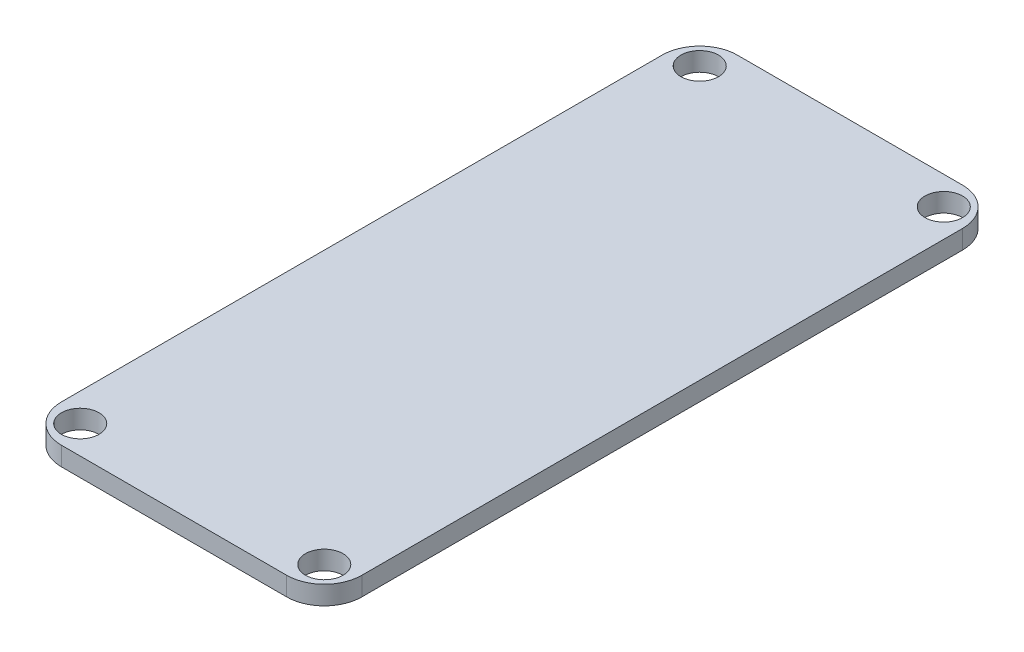
ISO-10303-21;
HEADER;
FILE_DESCRIPTION(('STEP AP214'),'2;1');
FILE_NAME('part.step','',(''),(''),'','','');
FILE_SCHEMA(('AUTOMOTIVE_DESIGN { 1 0 10303 214 1 1 1 1 }'));
ENDSEC;
DATA;
#1=APPLICATION_CONTEXT('core data for automotive mechanical design processes');
#2=APPLICATION_PROTOCOL_DEFINITION('international standard','automotive_design',2000,#1);
#3=PRODUCT_CONTEXT('',#1,'mechanical');
#4=PRODUCT('Part','Part','',(#3));
#5=PRODUCT_RELATED_PRODUCT_CATEGORY('part','',(#4));
#6=PRODUCT_DEFINITION_FORMATION('','',#4);
#7=PRODUCT_DEFINITION_CONTEXT('part definition',#1,'design');
#8=PRODUCT_DEFINITION('design','',#6,#7);
#9=PRODUCT_DEFINITION_SHAPE('','',#8);
#10=(LENGTH_UNIT() NAMED_UNIT(*) SI_UNIT(.MILLI.,.METRE.));
#11=(NAMED_UNIT(*) PLANE_ANGLE_UNIT() SI_UNIT($,.RADIAN.));
#12=(NAMED_UNIT(*) SI_UNIT($,.STERADIAN.) SOLID_ANGLE_UNIT());
#13=UNCERTAINTY_MEASURE_WITH_UNIT(LENGTH_MEASURE(1.E-05),#10,'distance_accuracy_value','');
#14=(GEOMETRIC_REPRESENTATION_CONTEXT(3) GLOBAL_UNCERTAINTY_ASSIGNED_CONTEXT((#13)) GLOBAL_UNIT_ASSIGNED_CONTEXT((#10,
#11,#12)) REPRESENTATION_CONTEXT('',''));
#15=CARTESIAN_POINT('',(0.,0.,0.));
#16=DIRECTION('',(0.,0.,1.));
#17=DIRECTION('',(1.,0.,0.));
#18=AXIS2_PLACEMENT_3D('',#15,#16,#17);
#19=CARTESIAN_POINT('',(0.,1.5875,0.));
#20=DIRECTION('',(1.,0.,0.));
#21=DIRECTION('',(0.,0.,-1.));
#22=AXIS2_PLACEMENT_3D('',#19,#20,#21);
#23=PLANE('',#22);
#24=DIRECTION('',(0.,0.,1.));
#25=VECTOR('',#24,1.);
#26=CARTESIAN_POINT('',(0.,1.5875,0.));
#27=LINE('',#26,#25);
#28=CARTESIAN_POINT('',(0.,1.5875,-53.975));
#29=VERTEX_POINT('',#28);
#30=CARTESIAN_POINT('',(0.,1.5875,-3.175));
#31=VERTEX_POINT('',#30);
#32=EDGE_CURVE('E130',#29,#31,#27,.T.);
#33=ORIENTED_EDGE('',*,*,#32,.F.);
#34=DIRECTION('',(0.,-1.,0.));
#35=VECTOR('',#34,1.);
#36=CARTESIAN_POINT('',(0.,1.5875,-53.975));
#37=LINE('',#36,#35);
#38=CARTESIAN_POINT('',(0.,0.,-53.975));
#39=VERTEX_POINT('',#38);
#40=EDGE_CURVE('E114',#29,#39,#37,.T.);
#41=ORIENTED_EDGE('',*,*,#40,.T.);
#42=DIRECTION('',(0.,0.,1.));
#43=VECTOR('',#42,1.);
#44=CARTESIAN_POINT('',(0.,0.,0.));
#45=LINE('',#44,#43);
#46=CARTESIAN_POINT('',(0.,0.,-3.175));
#47=VERTEX_POINT('',#46);
#48=EDGE_CURVE('E127',#39,#47,#45,.T.);
#49=ORIENTED_EDGE('',*,*,#48,.T.);
#50=DIRECTION('',(0.,-1.,0.));
#51=VECTOR('',#50,1.);
#52=CARTESIAN_POINT('',(0.,1.5875,-3.175));
#53=LINE('',#52,#51);
#54=EDGE_CURVE('E133',#47,#31,#53,.F.);
#55=ORIENTED_EDGE('',*,*,#54,.T.);
#56=EDGE_LOOP('',(#33,#41,#49,#55));
#57=FACE_BOUND('',#56,.T.);
#58=ADVANCED_FACE('F43',(#57),#23,.F.);
#59=CARTESIAN_POINT('',(0.,1.5875,0.));
#60=DIRECTION('',(0.,0.,-1.));
#61=DIRECTION('',(-1.,0.,0.));
#62=AXIS2_PLACEMENT_3D('',#59,#60,#61);
#63=PLANE('',#62);
#64=DIRECTION('',(1.,0.,0.));
#65=VECTOR('',#64,1.);
#66=CARTESIAN_POINT('',(0.,0.,0.));
#67=LINE('',#66,#65);
#68=CARTESIAN_POINT('',(3.175,0.,0.));
#69=VERTEX_POINT('',#68);
#70=CARTESIAN_POINT('',(22.225,0.,0.));
#71=VERTEX_POINT('',#70);
#72=EDGE_CURVE('E138',#69,#71,#67,.T.);
#73=ORIENTED_EDGE('',*,*,#72,.T.);
#74=DIRECTION('',(0.,-1.,0.));
#75=VECTOR('',#74,1.);
#76=CARTESIAN_POINT('',(22.225,1.5875,0.));
#77=LINE('',#76,#75);
#78=CARTESIAN_POINT('',(22.225,1.5875,0.));
#79=VERTEX_POINT('',#78);
#80=EDGE_CURVE('E11',#71,#79,#77,.F.);
#81=ORIENTED_EDGE('',*,*,#80,.T.);
#82=DIRECTION('',(1.,0.,0.));
#83=VECTOR('',#82,1.);
#84=CARTESIAN_POINT('',(0.,1.5875,0.));
#85=LINE('',#84,#83);
#86=CARTESIAN_POINT('',(3.175,1.5875,0.));
#87=VERTEX_POINT('',#86);
#88=EDGE_CURVE('E195',#87,#79,#85,.T.);
#89=ORIENTED_EDGE('',*,*,#88,.F.);
#90=DIRECTION('',(0.,-1.,0.));
#91=VECTOR('',#90,1.);
#92=CARTESIAN_POINT('',(3.175,1.5875,0.));
#93=LINE('',#92,#91);
#94=EDGE_CURVE('E52',#87,#69,#93,.T.);
#95=ORIENTED_EDGE('',*,*,#94,.T.);
#96=EDGE_LOOP('',(#73,#81,#89,#95));
#97=FACE_BOUND('',#96,.T.);
#98=ADVANCED_FACE('F193',(#97),#63,.F.);
#99=CARTESIAN_POINT('',(25.4,1.5875,0.));
#100=DIRECTION('',(-1.,0.,0.));
#101=DIRECTION('',(0.,0.,1.));
#102=AXIS2_PLACEMENT_3D('',#99,#100,#101);
#103=PLANE('',#102);
#104=DIRECTION('',(0.,0.,-1.));
#105=VECTOR('',#104,1.);
#106=CARTESIAN_POINT('',(25.4,0.,0.));
#107=LINE('',#106,#105);
#108=CARTESIAN_POINT('',(25.4,0.,-3.175));
#109=VERTEX_POINT('',#108);
#110=CARTESIAN_POINT('',(25.4,0.,-53.975));
#111=VERTEX_POINT('',#110);
#112=EDGE_CURVE('E144',#109,#111,#107,.T.);
#113=ORIENTED_EDGE('',*,*,#112,.T.);
#114=DIRECTION('',(0.,-1.,0.));
#115=VECTOR('',#114,1.);
#116=CARTESIAN_POINT('',(25.4,1.5875,-53.975));
#117=LINE('',#116,#115);
#118=CARTESIAN_POINT('',(25.4,1.5875,-53.975));
#119=VERTEX_POINT('',#118);
#120=EDGE_CURVE('E59',#111,#119,#117,.F.);
#121=ORIENTED_EDGE('',*,*,#120,.T.);
#122=DIRECTION('',(0.,0.,-1.));
#123=VECTOR('',#122,1.);
#124=CARTESIAN_POINT('',(25.4,1.5875,0.));
#125=LINE('',#124,#123);
#126=CARTESIAN_POINT('',(25.4,1.5875,-3.175));
#127=VERTEX_POINT('',#126);
#128=EDGE_CURVE('E203',#127,#119,#125,.T.);
#129=ORIENTED_EDGE('',*,*,#128,.F.);
#130=DIRECTION('',(0.,-1.,0.));
#131=VECTOR('',#130,1.);
#132=CARTESIAN_POINT('',(25.4,1.5875,-3.175));
#133=LINE('',#132,#131);
#134=EDGE_CURVE('E183',#127,#109,#133,.T.);
#135=ORIENTED_EDGE('',*,*,#134,.T.);
#136=EDGE_LOOP('',(#113,#121,#129,#135));
#137=FACE_BOUND('',#136,.T.);
#138=ADVANCED_FACE('F202',(#137),#103,.F.);
#139=CARTESIAN_POINT('',(0.,1.5875,-57.15));
#140=DIRECTION('',(0.,0.,1.));
#141=DIRECTION('',(1.,0.,0.));
#142=AXIS2_PLACEMENT_3D('',#139,#140,#141);
#143=PLANE('',#142);
#144=DIRECTION('',(-1.,0.,0.));
#145=VECTOR('',#144,1.);
#146=CARTESIAN_POINT('',(0.,0.,-57.15));
#147=LINE('',#146,#145);
#148=CARTESIAN_POINT('',(22.225,0.,-57.15));
#149=VERTEX_POINT('',#148);
#150=CARTESIAN_POINT('',(3.175,0.,-57.15));
#151=VERTEX_POINT('',#150);
#152=EDGE_CURVE('E155',#149,#151,#147,.T.);
#153=ORIENTED_EDGE('',*,*,#152,.T.);
#154=DIRECTION('',(0.,-1.,0.));
#155=VECTOR('',#154,1.);
#156=CARTESIAN_POINT('',(3.175,1.5875,-57.15));
#157=LINE('',#156,#155);
#158=CARTESIAN_POINT('',(3.175,1.5875,-57.15));
#159=VERTEX_POINT('',#158);
#160=EDGE_CURVE('E115',#151,#159,#157,.F.);
#161=ORIENTED_EDGE('',*,*,#160,.T.);
#162=DIRECTION('',(-1.,0.,0.));
#163=VECTOR('',#162,1.);
#164=CARTESIAN_POINT('',(0.,1.5875,-57.15));
#165=LINE('',#164,#163);
#166=CARTESIAN_POINT('',(22.225,1.5875,-57.15));
#167=VERTEX_POINT('',#166);
#168=EDGE_CURVE('E150',#167,#159,#165,.T.);
#169=ORIENTED_EDGE('',*,*,#168,.F.);
#170=DIRECTION('',(0.,-1.,0.));
#171=VECTOR('',#170,1.);
#172=CARTESIAN_POINT('',(22.225,1.5875,-57.15));
#173=LINE('',#172,#171);
#174=EDGE_CURVE('E121',#167,#149,#173,.T.);
#175=ORIENTED_EDGE('',*,*,#174,.T.);
#176=EDGE_LOOP('',(#153,#161,#169,#175));
#177=FACE_BOUND('',#176,.T.);
#178=ADVANCED_FACE('F246',(#177),#143,.F.);
#179=CARTESIAN_POINT('',(0.,1.5875,0.));
#180=DIRECTION('',(0.,-1.,0.));
#181=DIRECTION('',(0.,0.,-1.));
#182=AXIS2_PLACEMENT_3D('',#179,#180,#181);
#183=PLANE('',#182);
#184=CARTESIAN_POINT('',(2.38125,1.5875,-54.76875));
#185=DIRECTION('',(0.,1.,0.));
#186=DIRECTION('',(0.,0.,1.));
#187=AXIS2_PLACEMENT_3D('',#184,#185,#186);
#188=CIRCLE('',#187,1.5875);
#189=CARTESIAN_POINT('',(2.38125,1.5875,-53.18125));
#190=VERTEX_POINT('',#189);
#191=EDGE_CURVE('E215',#190,#190,#188,.T.);
#192=ORIENTED_EDGE('',*,*,#191,.F.);
#193=EDGE_LOOP('',(#192));
#194=FACE_BOUND('',#193,.T.);
#195=CARTESIAN_POINT('',(23.01875,1.5875,-2.38125));
#196=DIRECTION('',(0.,1.,0.));
#197=DIRECTION('',(0.,0.,1.));
#198=AXIS2_PLACEMENT_3D('',#195,#196,#197);
#199=CIRCLE('',#198,1.5875);
#200=CARTESIAN_POINT('',(23.01875,1.5875,-0.793750000000001));
#201=VERTEX_POINT('',#200);
#202=EDGE_CURVE('E221',#201,#201,#199,.T.);
#203=ORIENTED_EDGE('',*,*,#202,.F.);
#204=EDGE_LOOP('',(#203));
#205=FACE_BOUND('',#204,.T.);
#206=CARTESIAN_POINT('',(2.38125,1.5875,-2.38125));
#207=DIRECTION('',(0.,1.,0.));
#208=DIRECTION('',(0.,0.,1.));
#209=AXIS2_PLACEMENT_3D('',#206,#207,#208);
#210=CIRCLE('',#209,1.5875);
#211=CARTESIAN_POINT('',(2.38125,1.5875,-0.79375));
#212=VERTEX_POINT('',#211);
#213=EDGE_CURVE('E222',#212,#212,#210,.T.);
#214=ORIENTED_EDGE('',*,*,#213,.F.);
#215=EDGE_LOOP('',(#214));
#216=FACE_BOUND('',#215,.T.);
#217=CARTESIAN_POINT('',(23.01875,1.5875,-54.76875));
#218=DIRECTION('',(0.,1.,0.));
#219=DIRECTION('',(0.,0.,1.));
#220=AXIS2_PLACEMENT_3D('',#217,#218,#219);
#221=CIRCLE('',#220,1.5875);
#222=CARTESIAN_POINT('',(23.01875,1.5875,-53.18125));
#223=VERTEX_POINT('',#222);
#224=EDGE_CURVE('E147',#223,#223,#221,.T.);
#225=ORIENTED_EDGE('',*,*,#224,.F.);
#226=EDGE_LOOP('',(#225));
#227=FACE_BOUND('',#226,.T.);
#228=ORIENTED_EDGE('',*,*,#168,.T.);
#229=CARTESIAN_POINT('',(3.175,1.5875,-53.975));
#230=DIRECTION('',(0.,-1.,0.));
#231=DIRECTION('',(0.,0.,-1.));
#232=AXIS2_PLACEMENT_3D('',#229,#230,#231);
#233=CIRCLE('',#232,3.175);
#234=EDGE_CURVE('E180',#159,#29,#233,.F.);
#235=ORIENTED_EDGE('',*,*,#234,.T.);
#236=ORIENTED_EDGE('',*,*,#32,.T.);
#237=CARTESIAN_POINT('',(3.175,1.5875,-3.175));
#238=DIRECTION('',(0.,-1.,0.));
#239=DIRECTION('',(0.,0.,-1.));
#240=AXIS2_PLACEMENT_3D('',#237,#238,#239);
#241=CIRCLE('',#240,3.175);
#242=EDGE_CURVE('E172',#31,#87,#241,.F.);
#243=ORIENTED_EDGE('',*,*,#242,.T.);
#244=ORIENTED_EDGE('',*,*,#88,.T.);
#245=CARTESIAN_POINT('',(22.225,1.5875,-3.175));
#246=DIRECTION('',(0.,-1.,0.));
#247=DIRECTION('',(0.,0.,-1.));
#248=AXIS2_PLACEMENT_3D('',#245,#246,#247);
#249=CIRCLE('',#248,3.175);
#250=EDGE_CURVE('E66',#79,#127,#249,.F.);
#251=ORIENTED_EDGE('',*,*,#250,.T.);
#252=ORIENTED_EDGE('',*,*,#128,.T.);
#253=CARTESIAN_POINT('',(22.225,1.5875,-53.975));
#254=DIRECTION('',(0.,-1.,0.));
#255=DIRECTION('',(0.,0.,-1.));
#256=AXIS2_PLACEMENT_3D('',#253,#254,#255);
#257=CIRCLE('',#256,3.175);
#258=EDGE_CURVE('E177',#119,#167,#257,.F.);
#259=ORIENTED_EDGE('',*,*,#258,.T.);
#260=EDGE_LOOP('',(#228,#235,#236,#243,#244,#251,#252,#259));
#261=FACE_BOUND('',#260,.T.);
#262=ADVANCED_FACE('F243',(#194,#205,#216,#227,#261),#183,.F.);
#263=CARTESIAN_POINT('',(0.,0.,0.));
#264=DIRECTION('',(0.,-1.,0.));
#265=DIRECTION('',(0.,0.,-1.));
#266=AXIS2_PLACEMENT_3D('',#263,#264,#265);
#267=PLANE('',#266);
#268=CARTESIAN_POINT('',(2.38125,0.,-54.76875));
#269=DIRECTION('',(0.,1.,0.));
#270=DIRECTION('',(0.,0.,1.));
#271=AXIS2_PLACEMENT_3D('',#268,#269,#270);
#272=CIRCLE('',#271,1.5875);
#273=CARTESIAN_POINT('',(2.38125,0.,-53.18125));
#274=VERTEX_POINT('',#273);
#275=EDGE_CURVE('E226',#274,#274,#272,.T.);
#276=ORIENTED_EDGE('',*,*,#275,.T.);
#277=EDGE_LOOP('',(#276));
#278=FACE_BOUND('',#277,.T.);
#279=CARTESIAN_POINT('',(23.01875,0.,-2.38125));
#280=DIRECTION('',(0.,1.,0.));
#281=DIRECTION('',(0.,0.,1.));
#282=AXIS2_PLACEMENT_3D('',#279,#280,#281);
#283=CIRCLE('',#282,1.5875);
#284=CARTESIAN_POINT('',(23.01875,0.,-0.793750000000001));
#285=VERTEX_POINT('',#284);
#286=EDGE_CURVE('E217',#285,#285,#283,.T.);
#287=ORIENTED_EDGE('',*,*,#286,.T.);
#288=EDGE_LOOP('',(#287));
#289=FACE_BOUND('',#288,.T.);
#290=CARTESIAN_POINT('',(2.38125,0.,-2.38125));
#291=DIRECTION('',(0.,1.,0.));
#292=DIRECTION('',(0.,0.,1.));
#293=AXIS2_PLACEMENT_3D('',#290,#291,#292);
#294=CIRCLE('',#293,1.5875);
#295=CARTESIAN_POINT('',(2.38125,0.,-0.79375));
#296=VERTEX_POINT('',#295);
#297=EDGE_CURVE('E233',#296,#296,#294,.T.);
#298=ORIENTED_EDGE('',*,*,#297,.T.);
#299=EDGE_LOOP('',(#298));
#300=FACE_BOUND('',#299,.T.);
#301=CARTESIAN_POINT('',(23.01875,0.,-54.76875));
#302=DIRECTION('',(0.,1.,0.));
#303=DIRECTION('',(0.,0.,1.));
#304=AXIS2_PLACEMENT_3D('',#301,#302,#303);
#305=CIRCLE('',#304,1.5875);
#306=CARTESIAN_POINT('',(23.01875,0.,-53.18125));
#307=VERTEX_POINT('',#306);
#308=EDGE_CURVE('E139',#307,#307,#305,.T.);
#309=ORIENTED_EDGE('',*,*,#308,.T.);
#310=EDGE_LOOP('',(#309));
#311=FACE_BOUND('',#310,.T.);
#312=ORIENTED_EDGE('',*,*,#48,.F.);
#313=CARTESIAN_POINT('',(3.175,0.,-53.975));
#314=DIRECTION('',(0.,-1.,0.));
#315=DIRECTION('',(0.,0.,-1.));
#316=AXIS2_PLACEMENT_3D('',#313,#314,#315);
#317=CIRCLE('',#316,3.175);
#318=EDGE_CURVE('E110',#39,#151,#317,.T.);
#319=ORIENTED_EDGE('',*,*,#318,.T.);
#320=ORIENTED_EDGE('',*,*,#152,.F.);
#321=CARTESIAN_POINT('',(22.225,0.,-53.975));
#322=DIRECTION('',(0.,-1.,0.));
#323=DIRECTION('',(0.,0.,-1.));
#324=AXIS2_PLACEMENT_3D('',#321,#322,#323);
#325=CIRCLE('',#324,3.175);
#326=EDGE_CURVE('E122',#149,#111,#325,.T.);
#327=ORIENTED_EDGE('',*,*,#326,.T.);
#328=ORIENTED_EDGE('',*,*,#112,.F.);
#329=CARTESIAN_POINT('',(22.225,0.,-3.175));
#330=DIRECTION('',(0.,-1.,0.));
#331=DIRECTION('',(0.,0.,-1.));
#332=AXIS2_PLACEMENT_3D('',#329,#330,#331);
#333=CIRCLE('',#332,3.175);
#334=EDGE_CURVE('E162',#109,#71,#333,.T.);
#335=ORIENTED_EDGE('',*,*,#334,.T.);
#336=ORIENTED_EDGE('',*,*,#72,.F.);
#337=CARTESIAN_POINT('',(3.175,0.,-3.175));
#338=DIRECTION('',(0.,-1.,0.));
#339=DIRECTION('',(0.,0.,-1.));
#340=AXIS2_PLACEMENT_3D('',#337,#338,#339);
#341=CIRCLE('',#340,3.175);
#342=EDGE_CURVE('E132',#69,#47,#341,.T.);
#343=ORIENTED_EDGE('',*,*,#342,.T.);
#344=EDGE_LOOP('',(#312,#319,#320,#327,#328,#335,#336,#343));
#345=FACE_BOUND('',#344,.T.);
#346=ADVANCED_FACE('F135',(#278,#289,#300,#311,#345),#267,.T.);
#347=CARTESIAN_POINT('',(23.01875,0.,-54.76875));
#348=DIRECTION('',(0.,1.,0.));
#349=DIRECTION('',(0.,0.,1.));
#350=AXIS2_PLACEMENT_3D('',#347,#348,#349);
#351=CYLINDRICAL_SURFACE('',#350,1.5875);
#352=ORIENTED_EDGE('',*,*,#308,.F.);
#353=EDGE_LOOP('',(#352));
#354=FACE_BOUND('',#353,.T.);
#355=ORIENTED_EDGE('',*,*,#224,.T.);
#356=EDGE_LOOP('',(#355));
#357=FACE_BOUND('',#356,.T.);
#358=ADVANCED_FACE('F275',(#354,#357),#351,.F.);
#359=CARTESIAN_POINT('',(2.38125,0.,-2.38125));
#360=DIRECTION('',(0.,1.,0.));
#361=DIRECTION('',(0.,0.,1.));
#362=AXIS2_PLACEMENT_3D('',#359,#360,#361);
#363=CYLINDRICAL_SURFACE('',#362,1.5875);
#364=ORIENTED_EDGE('',*,*,#297,.F.);
#365=EDGE_LOOP('',(#364));
#366=FACE_BOUND('',#365,.T.);
#367=ORIENTED_EDGE('',*,*,#213,.T.);
#368=EDGE_LOOP('',(#367));
#369=FACE_BOUND('',#368,.T.);
#370=ADVANCED_FACE('F241',(#366,#369),#363,.F.);
#371=CARTESIAN_POINT('',(23.01875,0.,-2.38125));
#372=DIRECTION('',(0.,1.,0.));
#373=DIRECTION('',(0.,0.,1.));
#374=AXIS2_PLACEMENT_3D('',#371,#372,#373);
#375=CYLINDRICAL_SURFACE('',#374,1.5875);
#376=ORIENTED_EDGE('',*,*,#286,.F.);
#377=EDGE_LOOP('',(#376));
#378=FACE_BOUND('',#377,.T.);
#379=ORIENTED_EDGE('',*,*,#202,.T.);
#380=EDGE_LOOP('',(#379));
#381=FACE_BOUND('',#380,.T.);
#382=ADVANCED_FACE('F281',(#378,#381),#375,.F.);
#383=CARTESIAN_POINT('',(2.38125,0.,-54.76875));
#384=DIRECTION('',(0.,1.,0.));
#385=DIRECTION('',(0.,0.,1.));
#386=AXIS2_PLACEMENT_3D('',#383,#384,#385);
#387=CYLINDRICAL_SURFACE('',#386,1.5875);
#388=ORIENTED_EDGE('',*,*,#275,.F.);
#389=EDGE_LOOP('',(#388));
#390=FACE_BOUND('',#389,.T.);
#391=ORIENTED_EDGE('',*,*,#191,.T.);
#392=EDGE_LOOP('',(#391));
#393=FACE_BOUND('',#392,.T.);
#394=ADVANCED_FACE('F261',(#390,#393),#387,.F.);
#395=CARTESIAN_POINT('',(3.175,1.5875,-53.975));
#396=DIRECTION('',(0.,-1.,0.));
#397=DIRECTION('',(0.,0.,-1.));
#398=AXIS2_PLACEMENT_3D('',#395,#396,#397);
#399=CYLINDRICAL_SURFACE('',#398,3.175);
#400=ORIENTED_EDGE('',*,*,#234,.F.);
#401=ORIENTED_EDGE('',*,*,#160,.F.);
#402=ORIENTED_EDGE('',*,*,#318,.F.);
#403=ORIENTED_EDGE('',*,*,#40,.F.);
#404=EDGE_LOOP('',(#400,#401,#402,#403));
#405=FACE_BOUND('',#404,.T.);
#406=ADVANCED_FACE('F113',(#405),#399,.T.);
#407=CARTESIAN_POINT('',(22.225,1.5875,-53.975));
#408=DIRECTION('',(0.,-1.,0.));
#409=DIRECTION('',(0.,0.,-1.));
#410=AXIS2_PLACEMENT_3D('',#407,#408,#409);
#411=CYLINDRICAL_SURFACE('',#410,3.175);
#412=ORIENTED_EDGE('',*,*,#258,.F.);
#413=ORIENTED_EDGE('',*,*,#120,.F.);
#414=ORIENTED_EDGE('',*,*,#326,.F.);
#415=ORIENTED_EDGE('',*,*,#174,.F.);
#416=EDGE_LOOP('',(#412,#413,#414,#415));
#417=FACE_BOUND('',#416,.T.);
#418=ADVANCED_FACE('F254',(#417),#411,.T.);
#419=CARTESIAN_POINT('',(22.225,1.5875,-3.175));
#420=DIRECTION('',(0.,-1.,0.));
#421=DIRECTION('',(0.,0.,-1.));
#422=AXIS2_PLACEMENT_3D('',#419,#420,#421);
#423=CYLINDRICAL_SURFACE('',#422,3.175);
#424=ORIENTED_EDGE('',*,*,#250,.F.);
#425=ORIENTED_EDGE('',*,*,#80,.F.);
#426=ORIENTED_EDGE('',*,*,#334,.F.);
#427=ORIENTED_EDGE('',*,*,#134,.F.);
#428=EDGE_LOOP('',(#424,#425,#426,#427));
#429=FACE_BOUND('',#428,.T.);
#430=ADVANCED_FACE('F201',(#429),#423,.T.);
#431=CARTESIAN_POINT('',(3.175,1.5875,-3.175));
#432=DIRECTION('',(0.,-1.,0.));
#433=DIRECTION('',(0.,0.,-1.));
#434=AXIS2_PLACEMENT_3D('',#431,#432,#433);
#435=CYLINDRICAL_SURFACE('',#434,3.175);
#436=ORIENTED_EDGE('',*,*,#242,.F.);
#437=ORIENTED_EDGE('',*,*,#54,.F.);
#438=ORIENTED_EDGE('',*,*,#342,.F.);
#439=ORIENTED_EDGE('',*,*,#94,.F.);
#440=EDGE_LOOP('',(#436,#437,#438,#439));
#441=FACE_BOUND('',#440,.T.);
#442=ADVANCED_FACE('F45',(#441),#435,.T.);
#443=CLOSED_SHELL('',(#58,#98,#138,#178,#262,#346,#358,#370,#382,#394,#406,#418,#430,#442));
#444=MANIFOLD_SOLID_BREP('B2',#443);
#445=ADVANCED_BREP_SHAPE_REPRESENTATION('',(#18,#444),#14);
#446=SHAPE_DEFINITION_REPRESENTATION(#9,#445);
ENDSEC;
END-ISO-10303-21;
